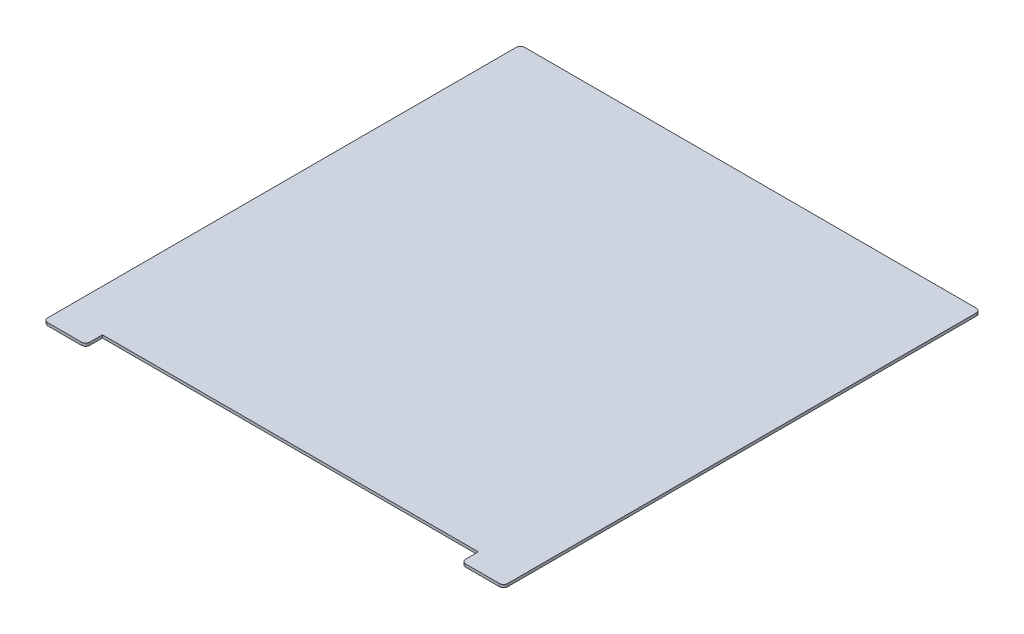
ISO-10303-21;
HEADER;
FILE_DESCRIPTION(('STEP AP214'),'2;1');
FILE_NAME('part.step','',(''),(''),'','','');
FILE_SCHEMA(('AUTOMOTIVE_DESIGN { 1 0 10303 214 1 1 1 1 }'));
ENDSEC;
DATA;
#1=APPLICATION_CONTEXT('core data for automotive mechanical design processes');
#2=APPLICATION_PROTOCOL_DEFINITION('international standard','automotive_design',2000,#1);
#3=PRODUCT_CONTEXT('',#1,'mechanical');
#4=PRODUCT('Part','Part','',(#3));
#5=PRODUCT_RELATED_PRODUCT_CATEGORY('part','',(#4));
#6=PRODUCT_DEFINITION_FORMATION('','',#4);
#7=PRODUCT_DEFINITION_CONTEXT('part definition',#1,'design');
#8=PRODUCT_DEFINITION('design','',#6,#7);
#9=PRODUCT_DEFINITION_SHAPE('','',#8);
#10=(LENGTH_UNIT() NAMED_UNIT(*) SI_UNIT(.MILLI.,.METRE.));
#11=(NAMED_UNIT(*) PLANE_ANGLE_UNIT() SI_UNIT($,.RADIAN.));
#12=(NAMED_UNIT(*) SI_UNIT($,.STERADIAN.) SOLID_ANGLE_UNIT());
#13=UNCERTAINTY_MEASURE_WITH_UNIT(LENGTH_MEASURE(1.E-05),#10,'distance_accuracy_value','');
#14=(GEOMETRIC_REPRESENTATION_CONTEXT(3) GLOBAL_UNCERTAINTY_ASSIGNED_CONTEXT((#13)) GLOBAL_UNIT_ASSIGNED_CONTEXT((#10,
#11,#12)) REPRESENTATION_CONTEXT('',''));
#15=CARTESIAN_POINT('',(0.,0.,0.));
#16=DIRECTION('',(0.,0.,1.));
#17=DIRECTION('',(1.,0.,0.));
#18=AXIS2_PLACEMENT_3D('',#15,#16,#17);
#19=CARTESIAN_POINT('',(-298.,2.,-142.350253807107));
#20=DIRECTION('',(1.,0.,0.));
#21=DIRECTION('',(0.,0.,-1.));
#22=AXIS2_PLACEMENT_3D('',#19,#20,#21);
#23=PLANE('',#22);
#24=DIRECTION('',(0.,0.,1.));
#25=VECTOR('',#24,1.);
#26=CARTESIAN_POINT('',(-298.,2.,-142.350253807107));
#27=LINE('',#26,#25);
#28=CARTESIAN_POINT('',(-298.,2.,-139.350253807107));
#29=VERTEX_POINT('',#28);
#30=CARTESIAN_POINT('',(-298.,2.,194.649746192893));
#31=VERTEX_POINT('',#30);
#32=EDGE_CURVE('E196',#29,#31,#27,.T.);
#33=ORIENTED_EDGE('',*,*,#32,.F.);
#34=DIRECTION('',(0.,-1.,0.));
#35=VECTOR('',#34,1.);
#36=CARTESIAN_POINT('',(-298.,2.,-139.350253807107));
#37=LINE('',#36,#35);
#38=CARTESIAN_POINT('',(-298.,0.,-139.350253807107));
#39=VERTEX_POINT('',#38);
#40=EDGE_CURVE('E231',#29,#39,#37,.T.);
#41=ORIENTED_EDGE('',*,*,#40,.T.);
#42=DIRECTION('',(0.,0.,1.));
#43=VECTOR('',#42,1.);
#44=CARTESIAN_POINT('',(-298.,0.,-142.350253807107));
#45=LINE('',#44,#43);
#46=CARTESIAN_POINT('',(-298.,0.,194.649746192893));
#47=VERTEX_POINT('',#46);
#48=EDGE_CURVE('E176',#39,#47,#45,.T.);
#49=ORIENTED_EDGE('',*,*,#48,.T.);
#50=DIRECTION('',(0.,-1.,0.));
#51=VECTOR('',#50,1.);
#52=CARTESIAN_POINT('',(-298.,2.,194.649746192893));
#53=LINE('',#52,#51);
#54=EDGE_CURVE('E229',#47,#31,#53,.F.);
#55=ORIENTED_EDGE('',*,*,#54,.T.);
#56=EDGE_LOOP('',(#33,#41,#49,#55));
#57=FACE_BOUND('',#56,.T.);
#58=ADVANCED_FACE('F37',(#57),#23,.F.);
#59=CARTESIAN_POINT('',(-298.,2.,197.649746192893));
#60=DIRECTION('',(0.,0.,-1.));
#61=DIRECTION('',(-1.,0.,0.));
#62=AXIS2_PLACEMENT_3D('',#59,#60,#61);
#63=PLANE('',#62);
#64=DIRECTION('',(1.,0.,0.));
#65=VECTOR('',#64,1.);
#66=CARTESIAN_POINT('',(-298.,0.,197.649746192893));
#67=LINE('',#66,#65);
#68=CARTESIAN_POINT('',(-295.,0.,197.649746192893));
#69=VERTEX_POINT('',#68);
#70=CARTESIAN_POINT('',(-271.,0.,197.649746192893));
#71=VERTEX_POINT('',#70);
#72=EDGE_CURVE('E179',#69,#71,#67,.T.);
#73=ORIENTED_EDGE('',*,*,#72,.T.);
#74=DIRECTION('',(0.,-1.,0.));
#75=VECTOR('',#74,1.);
#76=CARTESIAN_POINT('',(-271.,2.,197.649746192893));
#77=LINE('',#76,#75);
#78=CARTESIAN_POINT('',(-271.,2.,197.649746192893));
#79=VERTEX_POINT('',#78);
#80=EDGE_CURVE('E239',#71,#79,#77,.F.);
#81=ORIENTED_EDGE('',*,*,#80,.T.);
#82=DIRECTION('',(1.,0.,0.));
#83=VECTOR('',#82,1.);
#84=CARTESIAN_POINT('',(-298.,2.,197.649746192893));
#85=LINE('',#84,#83);
#86=CARTESIAN_POINT('',(-295.,2.,197.649746192893));
#87=VERTEX_POINT('',#86);
#88=EDGE_CURVE('E149',#87,#79,#85,.T.);
#89=ORIENTED_EDGE('',*,*,#88,.F.);
#90=DIRECTION('',(0.,-1.,0.));
#91=VECTOR('',#90,1.);
#92=CARTESIAN_POINT('',(-295.,2.,197.649746192893));
#93=LINE('',#92,#91);
#94=EDGE_CURVE('E236',#87,#69,#93,.T.);
#95=ORIENTED_EDGE('',*,*,#94,.T.);
#96=EDGE_LOOP('',(#73,#81,#89,#95));
#97=FACE_BOUND('',#96,.T.);
#98=ADVANCED_FACE('F295',(#97),#63,.F.);
#99=CARTESIAN_POINT('',(-268.,2.,197.649746192893));
#100=DIRECTION('',(-1.,0.,0.));
#101=DIRECTION('',(0.,0.,1.));
#102=AXIS2_PLACEMENT_3D('',#99,#100,#101);
#103=PLANE('',#102);
#104=DIRECTION('',(0.,0.,-1.));
#105=VECTOR('',#104,1.);
#106=CARTESIAN_POINT('',(-268.,2.,197.649746192893));
#107=LINE('',#106,#105);
#108=CARTESIAN_POINT('',(-268.,2.,194.649746192893));
#109=VERTEX_POINT('',#108);
#110=CARTESIAN_POINT('',(-268.,2.,185.649746192893));
#111=VERTEX_POINT('',#110);
#112=EDGE_CURVE('E136',#109,#111,#107,.T.);
#113=ORIENTED_EDGE('',*,*,#112,.F.);
#114=DIRECTION('',(0.,-1.,0.));
#115=VECTOR('',#114,1.);
#116=CARTESIAN_POINT('',(-268.,2.,194.649746192893));
#117=LINE('',#116,#115);
#118=CARTESIAN_POINT('',(-268.,0.,194.649746192893));
#119=VERTEX_POINT('',#118);
#120=EDGE_CURVE('E234',#109,#119,#117,.T.);
#121=ORIENTED_EDGE('',*,*,#120,.T.);
#122=DIRECTION('',(0.,0.,-1.));
#123=VECTOR('',#122,1.);
#124=CARTESIAN_POINT('',(-268.,0.,197.649746192893));
#125=LINE('',#124,#123);
#126=CARTESIAN_POINT('',(-268.,0.,185.649746192893));
#127=VERTEX_POINT('',#126);
#128=EDGE_CURVE('E155',#119,#127,#125,.T.);
#129=ORIENTED_EDGE('',*,*,#128,.T.);
#130=DIRECTION('',(0.,-1.,0.));
#131=VECTOR('',#130,1.);
#132=CARTESIAN_POINT('',(-268.,2.,185.649746192893));
#133=LINE('',#132,#131);
#134=EDGE_CURVE('E152',#111,#127,#133,.T.);
#135=ORIENTED_EDGE('',*,*,#134,.F.);
#136=EDGE_LOOP('',(#113,#121,#129,#135));
#137=FACE_BOUND('',#136,.T.);
#138=ADVANCED_FACE('F153',(#137),#103,.F.);
#139=CARTESIAN_POINT('',(-268.,2.,185.649746192893));
#140=DIRECTION('',(0.,0.,-1.));
#141=DIRECTION('',(-1.,0.,0.));
#142=AXIS2_PLACEMENT_3D('',#139,#140,#141);
#143=PLANE('',#142);
#144=DIRECTION('',(1.,0.,0.));
#145=VECTOR('',#144,1.);
#146=CARTESIAN_POINT('',(-268.,0.,185.649746192893));
#147=LINE('',#146,#145);
#148=CARTESIAN_POINT('',(0.,0.,185.649746192893));
#149=VERTEX_POINT('',#148);
#150=EDGE_CURVE('E183',#127,#149,#147,.T.);
#151=ORIENTED_EDGE('',*,*,#150,.T.);
#152=DIRECTION('',(0.,-1.,0.));
#153=VECTOR('',#152,1.);
#154=CARTESIAN_POINT('',(0.,2.,185.649746192893));
#155=LINE('',#154,#153);
#156=CARTESIAN_POINT('',(0.,2.,185.649746192893));
#157=VERTEX_POINT('',#156);
#158=EDGE_CURVE('E159',#157,#149,#155,.T.);
#159=ORIENTED_EDGE('',*,*,#158,.F.);
#160=DIRECTION('',(1.,0.,0.));
#161=VECTOR('',#160,1.);
#162=CARTESIAN_POINT('',(-268.,2.,185.649746192893));
#163=LINE('',#162,#161);
#164=EDGE_CURVE('E141',#111,#157,#163,.T.);
#165=ORIENTED_EDGE('',*,*,#164,.F.);
#166=ORIENTED_EDGE('',*,*,#134,.T.);
#167=EDGE_LOOP('',(#151,#159,#165,#166));
#168=FACE_BOUND('',#167,.T.);
#169=ADVANCED_FACE('F161',(#168),#143,.F.);
#170=CARTESIAN_POINT('',(0.,2.,185.649746192893));
#171=DIRECTION('',(1.,0.,0.));
#172=DIRECTION('',(0.,0.,-1.));
#173=AXIS2_PLACEMENT_3D('',#170,#171,#172);
#174=PLANE('',#173);
#175=DIRECTION('',(0.,0.,1.));
#176=VECTOR('',#175,1.);
#177=CARTESIAN_POINT('',(0.,0.,185.649746192893));
#178=LINE('',#177,#176);
#179=CARTESIAN_POINT('',(0.,0.,194.649746192893));
#180=VERTEX_POINT('',#179);
#181=EDGE_CURVE('E185',#149,#180,#178,.T.);
#182=ORIENTED_EDGE('',*,*,#181,.T.);
#183=DIRECTION('',(0.,-1.,0.));
#184=VECTOR('',#183,1.);
#185=CARTESIAN_POINT('',(0.,2.,194.649746192893));
#186=LINE('',#185,#184);
#187=CARTESIAN_POINT('',(0.,2.,194.649746192893));
#188=VERTEX_POINT('',#187);
#189=EDGE_CURVE('E11',#180,#188,#186,.F.);
#190=ORIENTED_EDGE('',*,*,#189,.T.);
#191=DIRECTION('',(0.,0.,1.));
#192=VECTOR('',#191,1.);
#193=CARTESIAN_POINT('',(0.,2.,185.649746192893));
#194=LINE('',#193,#192);
#195=EDGE_CURVE('E164',#157,#188,#194,.T.);
#196=ORIENTED_EDGE('',*,*,#195,.F.);
#197=ORIENTED_EDGE('',*,*,#158,.T.);
#198=EDGE_LOOP('',(#182,#190,#196,#197));
#199=FACE_BOUND('',#198,.T.);
#200=ADVANCED_FACE('F287',(#199),#174,.F.);
#201=CARTESIAN_POINT('',(0.,2.,197.649746192893));
#202=DIRECTION('',(0.,0.,-1.));
#203=DIRECTION('',(-1.,0.,0.));
#204=AXIS2_PLACEMENT_3D('',#201,#202,#203);
#205=PLANE('',#204);
#206=DIRECTION('',(1.,0.,0.));
#207=VECTOR('',#206,1.);
#208=CARTESIAN_POINT('',(0.,0.,197.649746192893));
#209=LINE('',#208,#207);
#210=CARTESIAN_POINT('',(3.,0.,197.649746192893));
#211=VERTEX_POINT('',#210);
#212=CARTESIAN_POINT('',(27.,0.,197.649746192893));
#213=VERTEX_POINT('',#212);
#214=EDGE_CURVE('E188',#211,#213,#209,.T.);
#215=ORIENTED_EDGE('',*,*,#214,.T.);
#216=DIRECTION('',(0.,-1.,0.));
#217=VECTOR('',#216,1.);
#218=CARTESIAN_POINT('',(27.,2.,197.649746192893));
#219=LINE('',#218,#217);
#220=CARTESIAN_POINT('',(27.,2.,197.649746192893));
#221=VERTEX_POINT('',#220);
#222=EDGE_CURVE('E45',#213,#221,#219,.F.);
#223=ORIENTED_EDGE('',*,*,#222,.T.);
#224=DIRECTION('',(1.,0.,0.));
#225=VECTOR('',#224,1.);
#226=CARTESIAN_POINT('',(0.,2.,197.649746192893));
#227=LINE('',#226,#225);
#228=CARTESIAN_POINT('',(3.,2.,197.649746192893));
#229=VERTEX_POINT('',#228);
#230=EDGE_CURVE('E166',#229,#221,#227,.T.);
#231=ORIENTED_EDGE('',*,*,#230,.F.);
#232=DIRECTION('',(0.,-1.,0.));
#233=VECTOR('',#232,1.);
#234=CARTESIAN_POINT('',(3.,2.,197.649746192893));
#235=LINE('',#234,#233);
#236=EDGE_CURVE('E241',#229,#211,#235,.T.);
#237=ORIENTED_EDGE('',*,*,#236,.T.);
#238=EDGE_LOOP('',(#215,#223,#231,#237));
#239=FACE_BOUND('',#238,.T.);
#240=ADVANCED_FACE('F245',(#239),#205,.F.);
#241=CARTESIAN_POINT('',(30.,2.,-142.350253807107));
#242=DIRECTION('',(-1.,0.,0.));
#243=DIRECTION('',(0.,0.,1.));
#244=AXIS2_PLACEMENT_3D('',#241,#242,#243);
#245=PLANE('',#244);
#246=DIRECTION('',(0.,0.,-1.));
#247=VECTOR('',#246,1.);
#248=CARTESIAN_POINT('',(30.,0.,-142.350253807107));
#249=LINE('',#248,#247);
#250=CARTESIAN_POINT('',(30.,0.,194.649746192893));
#251=VERTEX_POINT('',#250);
#252=CARTESIAN_POINT('',(30.,0.,-139.350253807107));
#253=VERTEX_POINT('',#252);
#254=EDGE_CURVE('E190',#251,#253,#249,.T.);
#255=ORIENTED_EDGE('',*,*,#254,.T.);
#256=DIRECTION('',(0.,-1.,0.));
#257=VECTOR('',#256,1.);
#258=CARTESIAN_POINT('',(30.,2.,-139.350253807107));
#259=LINE('',#258,#257);
#260=CARTESIAN_POINT('',(30.,2.,-139.350253807107));
#261=VERTEX_POINT('',#260);
#262=EDGE_CURVE('E217',#253,#261,#259,.F.);
#263=ORIENTED_EDGE('',*,*,#262,.T.);
#264=DIRECTION('',(0.,0.,-1.));
#265=VECTOR('',#264,1.);
#266=CARTESIAN_POINT('',(30.,2.,-142.350253807107));
#267=LINE('',#266,#265);
#268=CARTESIAN_POINT('',(30.,2.,194.649746192893));
#269=VERTEX_POINT('',#268);
#270=EDGE_CURVE('E171',#269,#261,#267,.T.);
#271=ORIENTED_EDGE('',*,*,#270,.F.);
#272=DIRECTION('',(0.,-1.,0.));
#273=VECTOR('',#272,1.);
#274=CARTESIAN_POINT('',(30.,2.,194.649746192893));
#275=LINE('',#274,#273);
#276=EDGE_CURVE('E214',#269,#251,#275,.T.);
#277=ORIENTED_EDGE('',*,*,#276,.T.);
#278=EDGE_LOOP('',(#255,#263,#271,#277));
#279=FACE_BOUND('',#278,.T.);
#280=ADVANCED_FACE('F258',(#279),#245,.F.);
#281=CARTESIAN_POINT('',(-298.,2.,-142.350253807107));
#282=DIRECTION('',(0.,0.,1.));
#283=DIRECTION('',(1.,0.,0.));
#284=AXIS2_PLACEMENT_3D('',#281,#282,#283);
#285=PLANE('',#284);
#286=DIRECTION('',(-1.,0.,0.));
#287=VECTOR('',#286,1.);
#288=CARTESIAN_POINT('',(-298.,2.,-142.350253807107));
#289=LINE('',#288,#287);
#290=CARTESIAN_POINT('',(27.,2.,-142.350253807107));
#291=VERTEX_POINT('',#290);
#292=CARTESIAN_POINT('',(-295.,2.,-142.350253807107));
#293=VERTEX_POINT('',#292);
#294=EDGE_CURVE('E173',#291,#293,#289,.T.);
#295=ORIENTED_EDGE('',*,*,#294,.F.);
#296=DIRECTION('',(0.,-1.,0.));
#297=VECTOR('',#296,1.);
#298=CARTESIAN_POINT('',(27.,2.,-142.350253807107));
#299=LINE('',#298,#297);
#300=CARTESIAN_POINT('',(27.,0.,-142.350253807107));
#301=VERTEX_POINT('',#300);
#302=EDGE_CURVE('E199',#291,#301,#299,.T.);
#303=ORIENTED_EDGE('',*,*,#302,.T.);
#304=DIRECTION('',(-1.,0.,0.));
#305=VECTOR('',#304,1.);
#306=CARTESIAN_POINT('',(-298.,0.,-142.350253807107));
#307=LINE('',#306,#305);
#308=CARTESIAN_POINT('',(-295.,0.,-142.350253807107));
#309=VERTEX_POINT('',#308);
#310=EDGE_CURVE('E193',#301,#309,#307,.T.);
#311=ORIENTED_EDGE('',*,*,#310,.T.);
#312=DIRECTION('',(0.,-1.,0.));
#313=VECTOR('',#312,1.);
#314=CARTESIAN_POINT('',(-295.,2.,-142.350253807107));
#315=LINE('',#314,#313);
#316=EDGE_CURVE('E158',#309,#293,#315,.F.);
#317=ORIENTED_EDGE('',*,*,#316,.T.);
#318=EDGE_LOOP('',(#295,#303,#311,#317));
#319=FACE_BOUND('',#318,.T.);
#320=ADVANCED_FACE('F266',(#319),#285,.F.);
#321=CARTESIAN_POINT('',(0.,2.,0.));
#322=DIRECTION('',(0.,1.,0.));
#323=DIRECTION('',(0.,0.,1.));
#324=AXIS2_PLACEMENT_3D('',#321,#322,#323);
#325=PLANE('',#324);
#326=ORIENTED_EDGE('',*,*,#270,.T.);
#327=CARTESIAN_POINT('',(27.,2.,-139.350253807107));
#328=DIRECTION('',(0.,1.,0.));
#329=DIRECTION('',(0.,0.,1.));
#330=AXIS2_PLACEMENT_3D('',#327,#328,#329);
#331=CIRCLE('',#330,3.);
#332=EDGE_CURVE('E227',#261,#291,#331,.T.);
#333=ORIENTED_EDGE('',*,*,#332,.T.);
#334=ORIENTED_EDGE('',*,*,#294,.T.);
#335=CARTESIAN_POINT('',(-295.,2.,-139.350253807107));
#336=DIRECTION('',(0.,1.,0.));
#337=DIRECTION('',(0.,0.,1.));
#338=AXIS2_PLACEMENT_3D('',#335,#336,#337);
#339=CIRCLE('',#338,3.);
#340=EDGE_CURVE('E225',#293,#29,#339,.T.);
#341=ORIENTED_EDGE('',*,*,#340,.T.);
#342=ORIENTED_EDGE('',*,*,#32,.T.);
#343=CARTESIAN_POINT('',(-295.,2.,194.649746192893));
#344=DIRECTION('',(0.,1.,0.));
#345=DIRECTION('',(0.,0.,1.));
#346=AXIS2_PLACEMENT_3D('',#343,#344,#345);
#347=CIRCLE('',#346,3.);
#348=EDGE_CURVE('E222',#31,#87,#347,.T.);
#349=ORIENTED_EDGE('',*,*,#348,.T.);
#350=ORIENTED_EDGE('',*,*,#88,.T.);
#351=CARTESIAN_POINT('',(-271.,2.,194.649746192893));
#352=DIRECTION('',(0.,1.,0.));
#353=DIRECTION('',(0.,0.,1.));
#354=AXIS2_PLACEMENT_3D('',#351,#352,#353);
#355=CIRCLE('',#354,3.);
#356=EDGE_CURVE('E145',#79,#109,#355,.T.);
#357=ORIENTED_EDGE('',*,*,#356,.T.);
#358=ORIENTED_EDGE('',*,*,#112,.T.);
#359=ORIENTED_EDGE('',*,*,#164,.T.);
#360=ORIENTED_EDGE('',*,*,#195,.T.);
#361=CARTESIAN_POINT('',(3.,2.,194.649746192893));
#362=DIRECTION('',(0.,1.,0.));
#363=DIRECTION('',(0.,0.,1.));
#364=AXIS2_PLACEMENT_3D('',#361,#362,#363);
#365=CIRCLE('',#364,3.);
#366=EDGE_CURVE('E58',#188,#229,#365,.T.);
#367=ORIENTED_EDGE('',*,*,#366,.T.);
#368=ORIENTED_EDGE('',*,*,#230,.T.);
#369=CARTESIAN_POINT('',(27.,2.,194.649746192893));
#370=DIRECTION('',(0.,1.,0.));
#371=DIRECTION('',(0.,0.,1.));
#372=AXIS2_PLACEMENT_3D('',#369,#370,#371);
#373=CIRCLE('',#372,3.);
#374=EDGE_CURVE('E220',#221,#269,#373,.T.);
#375=ORIENTED_EDGE('',*,*,#374,.T.);
#376=EDGE_LOOP('',(#326,#333,#334,#341,#342,#349,#350,#357,#358,#359,#360,#367,#368,#375));
#377=FACE_BOUND('',#376,.T.);
#378=ADVANCED_FACE('F139',(#377),#325,.T.);
#379=CARTESIAN_POINT('',(0.,0.,0.));
#380=DIRECTION('',(0.,1.,0.));
#381=DIRECTION('',(0.,0.,1.));
#382=AXIS2_PLACEMENT_3D('',#379,#380,#381);
#383=PLANE('',#382);
#384=ORIENTED_EDGE('',*,*,#310,.F.);
#385=CARTESIAN_POINT('',(27.,0.,-139.350253807107));
#386=DIRECTION('',(0.,1.,0.));
#387=DIRECTION('',(0.,0.,1.));
#388=AXIS2_PLACEMENT_3D('',#385,#386,#387);
#389=CIRCLE('',#388,3.);
#390=EDGE_CURVE('E212',#301,#253,#389,.F.);
#391=ORIENTED_EDGE('',*,*,#390,.T.);
#392=ORIENTED_EDGE('',*,*,#254,.F.);
#393=CARTESIAN_POINT('',(27.,0.,194.649746192893));
#394=DIRECTION('',(0.,1.,0.));
#395=DIRECTION('',(0.,0.,1.));
#396=AXIS2_PLACEMENT_3D('',#393,#394,#395);
#397=CIRCLE('',#396,3.);
#398=EDGE_CURVE('E204',#251,#213,#397,.F.);
#399=ORIENTED_EDGE('',*,*,#398,.T.);
#400=ORIENTED_EDGE('',*,*,#214,.F.);
#401=CARTESIAN_POINT('',(3.,0.,194.649746192893));
#402=DIRECTION('',(0.,1.,0.));
#403=DIRECTION('',(0.,0.,1.));
#404=AXIS2_PLACEMENT_3D('',#401,#402,#403);
#405=CIRCLE('',#404,3.);
#406=EDGE_CURVE('E202',#211,#180,#405,.F.);
#407=ORIENTED_EDGE('',*,*,#406,.T.);
#408=ORIENTED_EDGE('',*,*,#181,.F.);
#409=ORIENTED_EDGE('',*,*,#150,.F.);
#410=ORIENTED_EDGE('',*,*,#128,.F.);
#411=CARTESIAN_POINT('',(-271.,0.,194.649746192893));
#412=DIRECTION('',(0.,1.,0.));
#413=DIRECTION('',(0.,0.,1.));
#414=AXIS2_PLACEMENT_3D('',#411,#412,#413);
#415=CIRCLE('',#414,3.);
#416=EDGE_CURVE('E208',#119,#71,#415,.F.);
#417=ORIENTED_EDGE('',*,*,#416,.T.);
#418=ORIENTED_EDGE('',*,*,#72,.F.);
#419=CARTESIAN_POINT('',(-295.,0.,194.649746192893));
#420=DIRECTION('',(0.,1.,0.));
#421=DIRECTION('',(0.,0.,1.));
#422=AXIS2_PLACEMENT_3D('',#419,#420,#421);
#423=CIRCLE('',#422,3.);
#424=EDGE_CURVE('E206',#69,#47,#423,.F.);
#425=ORIENTED_EDGE('',*,*,#424,.T.);
#426=ORIENTED_EDGE('',*,*,#48,.F.);
#427=CARTESIAN_POINT('',(-295.,0.,-139.350253807107));
#428=DIRECTION('',(0.,1.,0.));
#429=DIRECTION('',(0.,0.,1.));
#430=AXIS2_PLACEMENT_3D('',#427,#428,#429);
#431=CIRCLE('',#430,3.);
#432=EDGE_CURVE('E210',#39,#309,#431,.F.);
#433=ORIENTED_EDGE('',*,*,#432,.T.);
#434=EDGE_LOOP('',(#384,#391,#392,#399,#400,#407,#408,#409,#410,#417,#418,#425,#426,#433));
#435=FACE_BOUND('',#434,.T.);
#436=ADVANCED_FACE('F249',(#435),#383,.F.);
#437=CARTESIAN_POINT('',(27.,2.,-139.350253807107));
#438=DIRECTION('',(0.,-1.,0.));
#439=DIRECTION('',(0.,0.,-1.));
#440=AXIS2_PLACEMENT_3D('',#437,#438,#439);
#441=CYLINDRICAL_SURFACE('',#440,3.);
#442=ORIENTED_EDGE('',*,*,#332,.F.);
#443=ORIENTED_EDGE('',*,*,#262,.F.);
#444=ORIENTED_EDGE('',*,*,#390,.F.);
#445=ORIENTED_EDGE('',*,*,#302,.F.);
#446=EDGE_LOOP('',(#442,#443,#444,#445));
#447=FACE_BOUND('',#446,.T.);
#448=ADVANCED_FACE('F264',(#447),#441,.T.);
#449=CARTESIAN_POINT('',(-295.,2.,-139.350253807107));
#450=DIRECTION('',(0.,-1.,0.));
#451=DIRECTION('',(0.,0.,-1.));
#452=AXIS2_PLACEMENT_3D('',#449,#450,#451);
#453=CYLINDRICAL_SURFACE('',#452,3.);
#454=ORIENTED_EDGE('',*,*,#340,.F.);
#455=ORIENTED_EDGE('',*,*,#316,.F.);
#456=ORIENTED_EDGE('',*,*,#432,.F.);
#457=ORIENTED_EDGE('',*,*,#40,.F.);
#458=EDGE_LOOP('',(#454,#455,#456,#457));
#459=FACE_BOUND('',#458,.T.);
#460=ADVANCED_FACE('F272',(#459),#453,.T.);
#461=CARTESIAN_POINT('',(-271.,2.,194.649746192893));
#462=DIRECTION('',(0.,-1.,0.));
#463=DIRECTION('',(0.,0.,-1.));
#464=AXIS2_PLACEMENT_3D('',#461,#462,#463);
#465=CYLINDRICAL_SURFACE('',#464,3.);
#466=ORIENTED_EDGE('',*,*,#356,.F.);
#467=ORIENTED_EDGE('',*,*,#80,.F.);
#468=ORIENTED_EDGE('',*,*,#416,.F.);
#469=ORIENTED_EDGE('',*,*,#120,.F.);
#470=EDGE_LOOP('',(#466,#467,#468,#469));
#471=FACE_BOUND('',#470,.T.);
#472=ADVANCED_FACE('F284',(#471),#465,.T.);
#473=CARTESIAN_POINT('',(-295.,2.,194.649746192893));
#474=DIRECTION('',(0.,-1.,0.));
#475=DIRECTION('',(0.,0.,-1.));
#476=AXIS2_PLACEMENT_3D('',#473,#474,#475);
#477=CYLINDRICAL_SURFACE('',#476,3.);
#478=ORIENTED_EDGE('',*,*,#348,.F.);
#479=ORIENTED_EDGE('',*,*,#54,.F.);
#480=ORIENTED_EDGE('',*,*,#424,.F.);
#481=ORIENTED_EDGE('',*,*,#94,.F.);
#482=EDGE_LOOP('',(#478,#479,#480,#481));
#483=FACE_BOUND('',#482,.T.);
#484=ADVANCED_FACE('F293',(#483),#477,.T.);
#485=CARTESIAN_POINT('',(27.,2.,194.649746192893));
#486=DIRECTION('',(0.,-1.,0.));
#487=DIRECTION('',(0.,0.,-1.));
#488=AXIS2_PLACEMENT_3D('',#485,#486,#487);
#489=CYLINDRICAL_SURFACE('',#488,3.);
#490=ORIENTED_EDGE('',*,*,#374,.F.);
#491=ORIENTED_EDGE('',*,*,#222,.F.);
#492=ORIENTED_EDGE('',*,*,#398,.F.);
#493=ORIENTED_EDGE('',*,*,#276,.F.);
#494=EDGE_LOOP('',(#490,#491,#492,#493));
#495=FACE_BOUND('',#494,.T.);
#496=ADVANCED_FACE('F255',(#495),#489,.T.);
#497=CARTESIAN_POINT('',(3.,2.,194.649746192893));
#498=DIRECTION('',(0.,-1.,0.));
#499=DIRECTION('',(0.,0.,-1.));
#500=AXIS2_PLACEMENT_3D('',#497,#498,#499);
#501=CYLINDRICAL_SURFACE('',#500,3.);
#502=ORIENTED_EDGE('',*,*,#366,.F.);
#503=ORIENTED_EDGE('',*,*,#189,.F.);
#504=ORIENTED_EDGE('',*,*,#406,.F.);
#505=ORIENTED_EDGE('',*,*,#236,.F.);
#506=EDGE_LOOP('',(#502,#503,#504,#505));
#507=FACE_BOUND('',#506,.T.);
#508=ADVANCED_FACE('F39',(#507),#501,.T.);
#509=CLOSED_SHELL('',(#58,#98,#138,#169,#200,#240,#280,#320,#378,#436,#448,#460,#472,#484,#496,#508));
#510=MANIFOLD_SOLID_BREP('B2',#509);
#511=ADVANCED_BREP_SHAPE_REPRESENTATION('',(#18,#510),#14);
#512=SHAPE_DEFINITION_REPRESENTATION(#9,#511);
ENDSEC;
END-ISO-10303-21;
